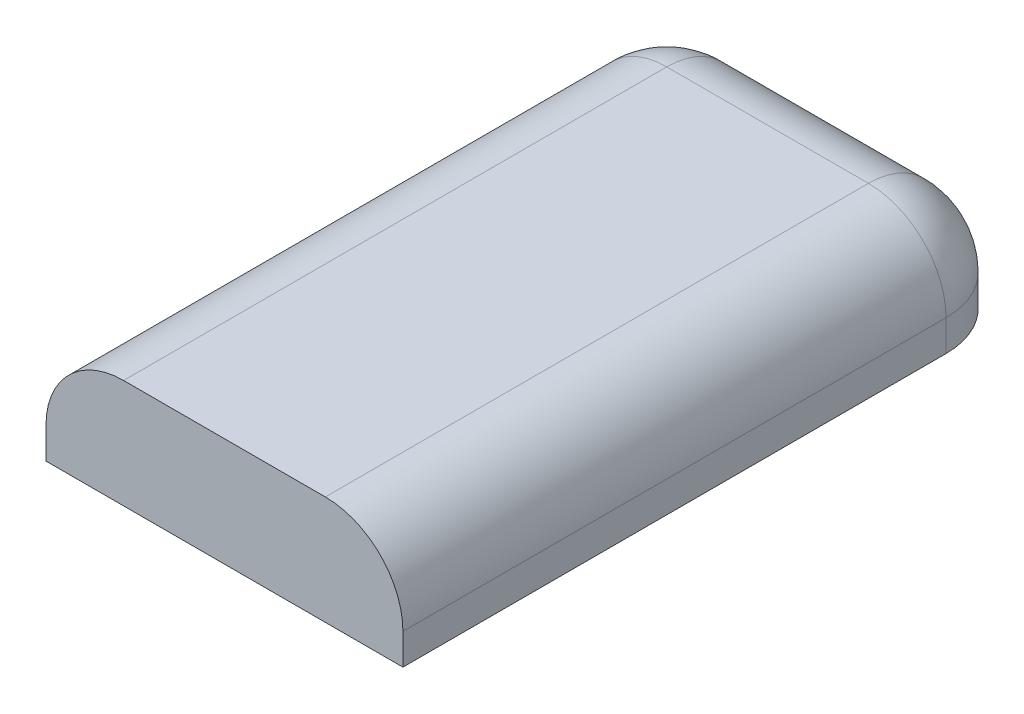
ISO-10303-21;
HEADER;
FILE_DESCRIPTION(('STEP AP214'),'2;1');
FILE_NAME('part.step','',(''),(''),'','','');
FILE_SCHEMA(('AUTOMOTIVE_DESIGN { 1 0 10303 214 1 1 1 1 }'));
ENDSEC;
DATA;
#1=APPLICATION_CONTEXT('core data for automotive mechanical design processes');
#2=APPLICATION_PROTOCOL_DEFINITION('international standard','automotive_design',2000,#1);
#3=PRODUCT_CONTEXT('',#1,'mechanical');
#4=PRODUCT('Part','Part','',(#3));
#5=PRODUCT_RELATED_PRODUCT_CATEGORY('part','',(#4));
#6=PRODUCT_DEFINITION_FORMATION('','',#4);
#7=PRODUCT_DEFINITION_CONTEXT('part definition',#1,'design');
#8=PRODUCT_DEFINITION('design','',#6,#7);
#9=PRODUCT_DEFINITION_SHAPE('','',#8);
#10=(LENGTH_UNIT() NAMED_UNIT(*) SI_UNIT(.MILLI.,.METRE.));
#11=(NAMED_UNIT(*) PLANE_ANGLE_UNIT() SI_UNIT($,.RADIAN.));
#12=(NAMED_UNIT(*) SI_UNIT($,.STERADIAN.) SOLID_ANGLE_UNIT());
#13=UNCERTAINTY_MEASURE_WITH_UNIT(LENGTH_MEASURE(1.E-05),#10,'distance_accuracy_value','');
#14=(GEOMETRIC_REPRESENTATION_CONTEXT(3) GLOBAL_UNCERTAINTY_ASSIGNED_CONTEXT((#13)) GLOBAL_UNIT_ASSIGNED_CONTEXT((#10,
#11,#12)) REPRESENTATION_CONTEXT('',''));
#15=CARTESIAN_POINT('',(0.,0.,0.));
#16=DIRECTION('',(0.,0.,1.));
#17=DIRECTION('',(1.,0.,0.));
#18=AXIS2_PLACEMENT_3D('',#15,#16,#17);
#19=CARTESIAN_POINT('',(11.5,7.,-20.));
#20=DIRECTION('',(-1.,0.,0.));
#21=DIRECTION('',(0.,0.,1.));
#22=AXIS2_PLACEMENT_3D('',#19,#20,#21);
#23=PLANE('',#22);
#24=DIRECTION('',(0.,-1.,0.));
#25=VECTOR('',#24,1.);
#26=CARTESIAN_POINT('',(11.5,7.,-15.));
#27=LINE('',#26,#25);
#28=CARTESIAN_POINT('',(11.5,0.,-15.));
#29=VERTEX_POINT('',#28);
#30=CARTESIAN_POINT('',(11.5,2.,-15.));
#31=VERTEX_POINT('',#30);
#32=EDGE_CURVE('E148',#29,#31,#27,.F.);
#33=ORIENTED_EDGE('',*,*,#32,.T.);
#34=DIRECTION('',(0.,0.,-1.));
#35=VECTOR('',#34,1.);
#36=CARTESIAN_POINT('',(11.5,2.,20.));
#37=LINE('',#36,#35);
#38=CARTESIAN_POINT('',(11.5,2.,20.));
#39=VERTEX_POINT('',#38);
#40=EDGE_CURVE('E11',#31,#39,#37,.F.);
#41=ORIENTED_EDGE('',*,*,#40,.T.);
#42=DIRECTION('',(0.,-1.,0.));
#43=VECTOR('',#42,1.);
#44=CARTESIAN_POINT('',(11.5,7.,20.));
#45=LINE('',#44,#43);
#46=CARTESIAN_POINT('',(11.5,0.,20.));
#47=VERTEX_POINT('',#46);
#48=EDGE_CURVE('E117',#39,#47,#45,.T.);
#49=ORIENTED_EDGE('',*,*,#48,.T.);
#50=DIRECTION('',(0.,0.,-1.));
#51=VECTOR('',#50,1.);
#52=CARTESIAN_POINT('',(11.5,0.,-20.));
#53=LINE('',#52,#51);
#54=EDGE_CURVE('E131',#47,#29,#53,.T.);
#55=ORIENTED_EDGE('',*,*,#54,.T.);
#56=EDGE_LOOP('',(#33,#41,#49,#55));
#57=FACE_BOUND('',#56,.T.);
#58=ADVANCED_FACE('F38',(#57),#23,.F.);
#59=CARTESIAN_POINT('',(-11.5,7.,-20.));
#60=DIRECTION('',(0.,0.,1.));
#61=DIRECTION('',(1.,0.,0.));
#62=AXIS2_PLACEMENT_3D('',#59,#60,#61);
#63=PLANE('',#62);
#64=DIRECTION('',(0.,-1.,0.));
#65=VECTOR('',#64,1.);
#66=CARTESIAN_POINT('',(-6.50000000000001,7.,-20.));
#67=LINE('',#66,#65);
#68=CARTESIAN_POINT('',(-6.50000000000001,0.,-20.));
#69=VERTEX_POINT('',#68);
#70=CARTESIAN_POINT('',(-6.50000000000001,2.,-20.));
#71=VERTEX_POINT('',#70);
#72=EDGE_CURVE('E142',#69,#71,#67,.F.);
#73=ORIENTED_EDGE('',*,*,#72,.T.);
#74=DIRECTION('',(-1.,0.,0.));
#75=VECTOR('',#74,1.);
#76=CARTESIAN_POINT('',(6.49999999999999,2.,-20.));
#77=LINE('',#76,#75);
#78=CARTESIAN_POINT('',(6.49999999999999,2.,-20.));
#79=VERTEX_POINT('',#78);
#80=EDGE_CURVE('E62',#71,#79,#77,.F.);
#81=ORIENTED_EDGE('',*,*,#80,.T.);
#82=DIRECTION('',(0.,-1.,0.));
#83=VECTOR('',#82,1.);
#84=CARTESIAN_POINT('',(6.49999999999999,7.,-20.));
#85=LINE('',#84,#83);
#86=CARTESIAN_POINT('',(6.49999999999999,0.,-20.));
#87=VERTEX_POINT('',#86);
#88=EDGE_CURVE('E144',#79,#87,#85,.T.);
#89=ORIENTED_EDGE('',*,*,#88,.T.);
#90=DIRECTION('',(-1.,0.,0.));
#91=VECTOR('',#90,1.);
#92=CARTESIAN_POINT('',(-11.5,0.,-20.));
#93=LINE('',#92,#91);
#94=EDGE_CURVE('E126',#87,#69,#93,.T.);
#95=ORIENTED_EDGE('',*,*,#94,.T.);
#96=EDGE_LOOP('',(#73,#81,#89,#95));
#97=FACE_BOUND('',#96,.T.);
#98=ADVANCED_FACE('F181',(#97),#63,.F.);
#99=CARTESIAN_POINT('',(-11.5,7.,-20.));
#100=DIRECTION('',(1.,0.,0.));
#101=DIRECTION('',(0.,0.,-1.));
#102=AXIS2_PLACEMENT_3D('',#99,#100,#101);
#103=PLANE('',#102);
#104=DIRECTION('',(0.,-1.,0.));
#105=VECTOR('',#104,1.);
#106=CARTESIAN_POINT('',(-11.5,7.,20.));
#107=LINE('',#106,#105);
#108=CARTESIAN_POINT('',(-11.5,2.,20.));
#109=VERTEX_POINT('',#108);
#110=CARTESIAN_POINT('',(-11.5,0.,20.));
#111=VERTEX_POINT('',#110);
#112=EDGE_CURVE('E105',#109,#111,#107,.T.);
#113=ORIENTED_EDGE('',*,*,#112,.F.);
#114=DIRECTION('',(0.,0.,1.));
#115=VECTOR('',#114,1.);
#116=CARTESIAN_POINT('',(-11.5,2.,-15.));
#117=LINE('',#116,#115);
#118=CARTESIAN_POINT('',(-11.5,2.,-15.));
#119=VERTEX_POINT('',#118);
#120=EDGE_CURVE('E160',#109,#119,#117,.F.);
#121=ORIENTED_EDGE('',*,*,#120,.T.);
#122=DIRECTION('',(0.,-1.,0.));
#123=VECTOR('',#122,1.);
#124=CARTESIAN_POINT('',(-11.5,7.,-15.));
#125=LINE('',#124,#123);
#126=CARTESIAN_POINT('',(-11.5,0.,-15.));
#127=VERTEX_POINT('',#126);
#128=EDGE_CURVE('E116',#119,#127,#125,.T.);
#129=ORIENTED_EDGE('',*,*,#128,.T.);
#130=DIRECTION('',(0.,0.,1.));
#131=VECTOR('',#130,1.);
#132=CARTESIAN_POINT('',(-11.5,0.,-20.));
#133=LINE('',#132,#131);
#134=EDGE_CURVE('E120',#127,#111,#133,.T.);
#135=ORIENTED_EDGE('',*,*,#134,.T.);
#136=EDGE_LOOP('',(#113,#121,#129,#135));
#137=FACE_BOUND('',#136,.T.);
#138=ADVANCED_FACE('F121',(#137),#103,.F.);
#139=CARTESIAN_POINT('',(-11.5,7.,20.));
#140=DIRECTION('',(0.,0.,-1.));
#141=DIRECTION('',(-1.,0.,0.));
#142=AXIS2_PLACEMENT_3D('',#139,#140,#141);
#143=PLANE('',#142);
#144=DIRECTION('',(1.,0.,0.));
#145=VECTOR('',#144,1.);
#146=CARTESIAN_POINT('',(-11.5,7.,20.));
#147=LINE('',#146,#145);
#148=CARTESIAN_POINT('',(-6.5,7.,20.));
#149=VERTEX_POINT('',#148);
#150=CARTESIAN_POINT('',(6.5,7.,20.));
#151=VERTEX_POINT('',#150);
#152=EDGE_CURVE('E132',#149,#151,#147,.T.);
#153=ORIENTED_EDGE('',*,*,#152,.F.);
#154=CARTESIAN_POINT('',(-6.5,2.,20.));
#155=DIRECTION('',(0.,0.,-1.));
#156=DIRECTION('',(-1.,0.,0.));
#157=AXIS2_PLACEMENT_3D('',#154,#155,#156);
#158=CIRCLE('',#157,5.);
#159=EDGE_CURVE('E113',#149,#109,#158,.F.);
#160=ORIENTED_EDGE('',*,*,#159,.T.);
#161=ORIENTED_EDGE('',*,*,#112,.T.);
#162=DIRECTION('',(1.,0.,0.));
#163=VECTOR('',#162,1.);
#164=CARTESIAN_POINT('',(-11.5,0.,20.));
#165=LINE('',#164,#163);
#166=EDGE_CURVE('E111',#111,#47,#165,.T.);
#167=ORIENTED_EDGE('',*,*,#166,.T.);
#168=ORIENTED_EDGE('',*,*,#48,.F.);
#169=CARTESIAN_POINT('',(6.5,2.,20.));
#170=DIRECTION('',(0.,0.,-1.));
#171=DIRECTION('',(-1.,0.,0.));
#172=AXIS2_PLACEMENT_3D('',#169,#170,#171);
#173=CIRCLE('',#172,5.);
#174=EDGE_CURVE('E157',#39,#151,#173,.F.);
#175=ORIENTED_EDGE('',*,*,#174,.T.);
#176=EDGE_LOOP('',(#153,#160,#161,#167,#168,#175));
#177=FACE_BOUND('',#176,.T.);
#178=ADVANCED_FACE('F108',(#177),#143,.F.);
#179=CARTESIAN_POINT('',(0.,7.,0.));
#180=DIRECTION('',(0.,1.,0.));
#181=DIRECTION('',(0.,0.,1.));
#182=AXIS2_PLACEMENT_3D('',#179,#180,#181);
#183=PLANE('',#182);
#184=DIRECTION('',(-1.,0.,0.));
#185=VECTOR('',#184,1.);
#186=CARTESIAN_POINT('',(-6.50000000000001,7.,-15.));
#187=LINE('',#186,#185);
#188=CARTESIAN_POINT('',(6.49999999999999,7.,-15.));
#189=VERTEX_POINT('',#188);
#190=CARTESIAN_POINT('',(-6.50000000000001,7.,-15.));
#191=VERTEX_POINT('',#190);
#192=EDGE_CURVE('E152',#189,#191,#187,.T.);
#193=ORIENTED_EDGE('',*,*,#192,.T.);
#194=DIRECTION('',(0.,0.,1.));
#195=VECTOR('',#194,1.);
#196=CARTESIAN_POINT('',(-6.5,7.,20.));
#197=LINE('',#196,#195);
#198=EDGE_CURVE('E154',#191,#149,#197,.T.);
#199=ORIENTED_EDGE('',*,*,#198,.T.);
#200=ORIENTED_EDGE('',*,*,#152,.T.);
#201=DIRECTION('',(0.,0.,-1.));
#202=VECTOR('',#201,1.);
#203=CARTESIAN_POINT('',(6.49999999999999,7.,-15.));
#204=LINE('',#203,#202);
#205=EDGE_CURVE('E150',#151,#189,#204,.T.);
#206=ORIENTED_EDGE('',*,*,#205,.T.);
#207=EDGE_LOOP('',(#193,#199,#200,#206));
#208=FACE_BOUND('',#207,.T.);
#209=ADVANCED_FACE('F195',(#208),#183,.T.);
#210=CARTESIAN_POINT('',(0.,0.,0.));
#211=DIRECTION('',(0.,1.,0.));
#212=DIRECTION('',(0.,0.,1.));
#213=AXIS2_PLACEMENT_3D('',#210,#211,#212);
#214=PLANE('',#213);
#215=ORIENTED_EDGE('',*,*,#94,.F.);
#216=CARTESIAN_POINT('',(6.49999999999999,0.,-15.));
#217=DIRECTION('',(0.,1.,0.));
#218=DIRECTION('',(0.,0.,1.));
#219=AXIS2_PLACEMENT_3D('',#216,#217,#218);
#220=CIRCLE('',#219,5.);
#221=EDGE_CURVE('E146',#87,#29,#220,.F.);
#222=ORIENTED_EDGE('',*,*,#221,.T.);
#223=ORIENTED_EDGE('',*,*,#54,.F.);
#224=ORIENTED_EDGE('',*,*,#166,.F.);
#225=ORIENTED_EDGE('',*,*,#134,.F.);
#226=CARTESIAN_POINT('',(-6.50000000000001,0.,-15.));
#227=DIRECTION('',(0.,1.,0.));
#228=DIRECTION('',(0.,0.,1.));
#229=AXIS2_PLACEMENT_3D('',#226,#227,#228);
#230=CIRCLE('',#229,5.);
#231=EDGE_CURVE('E140',#127,#69,#230,.F.);
#232=ORIENTED_EDGE('',*,*,#231,.T.);
#233=EDGE_LOOP('',(#215,#222,#223,#224,#225,#232));
#234=FACE_BOUND('',#233,.T.);
#235=ADVANCED_FACE('F129',(#234),#214,.F.);
#236=CARTESIAN_POINT('',(-6.50000000000001,7.,-15.));
#237=DIRECTION('',(0.,-1.,0.));
#238=DIRECTION('',(0.,0.,-1.));
#239=AXIS2_PLACEMENT_3D('',#236,#237,#238);
#240=CYLINDRICAL_SURFACE('',#239,5.);
#241=ORIENTED_EDGE('',*,*,#128,.F.);
#242=CARTESIAN_POINT('',(-6.50000000000001,2.,-15.));
#243=DIRECTION('',(0.,-1.,0.));
#244=DIRECTION('',(0.,0.,-1.));
#245=AXIS2_PLACEMENT_3D('',#242,#243,#244);
#246=CIRCLE('',#245,5.);
#247=EDGE_CURVE('E162',#119,#71,#246,.T.);
#248=ORIENTED_EDGE('',*,*,#247,.T.);
#249=ORIENTED_EDGE('',*,*,#72,.F.);
#250=ORIENTED_EDGE('',*,*,#231,.F.);
#251=EDGE_LOOP('',(#241,#248,#249,#250));
#252=FACE_BOUND('',#251,.T.);
#253=ADVANCED_FACE('F185',(#252),#240,.T.);
#254=CARTESIAN_POINT('',(6.49999999999999,7.,-15.));
#255=DIRECTION('',(0.,-1.,0.));
#256=DIRECTION('',(0.,0.,-1.));
#257=AXIS2_PLACEMENT_3D('',#254,#255,#256);
#258=CYLINDRICAL_SURFACE('',#257,5.);
#259=ORIENTED_EDGE('',*,*,#88,.F.);
#260=CARTESIAN_POINT('',(6.49999999999999,2.,-15.));
#261=DIRECTION('',(0.,-1.,0.));
#262=DIRECTION('',(0.,0.,-1.));
#263=AXIS2_PLACEMENT_3D('',#260,#261,#262);
#264=CIRCLE('',#263,5.);
#265=EDGE_CURVE('E47',#79,#31,#264,.T.);
#266=ORIENTED_EDGE('',*,*,#265,.T.);
#267=ORIENTED_EDGE('',*,*,#32,.F.);
#268=ORIENTED_EDGE('',*,*,#221,.F.);
#269=EDGE_LOOP('',(#259,#266,#267,#268));
#270=FACE_BOUND('',#269,.T.);
#271=ADVANCED_FACE('F219',(#270),#258,.T.);
#272=CARTESIAN_POINT('',(6.5,2.,0.));
#273=DIRECTION('',(0.,0.,1.));
#274=DIRECTION('',(1.,0.,0.));
#275=AXIS2_PLACEMENT_3D('',#272,#273,#274);
#276=CYLINDRICAL_SURFACE('',#275,5.);
#277=ORIENTED_EDGE('',*,*,#174,.F.);
#278=ORIENTED_EDGE('',*,*,#40,.F.);
#279=CARTESIAN_POINT('',(6.49999999999999,2.,-15.));
#280=DIRECTION('',(0.,0.,-1.));
#281=DIRECTION('',(-1.,0.,0.));
#282=AXIS2_PLACEMENT_3D('',#279,#280,#281);
#283=CIRCLE('',#282,5.);
#284=EDGE_CURVE('E42',#189,#31,#283,.T.);
#285=ORIENTED_EDGE('',*,*,#284,.F.);
#286=ORIENTED_EDGE('',*,*,#205,.F.);
#287=EDGE_LOOP('',(#277,#278,#285,#286));
#288=FACE_BOUND('',#287,.T.);
#289=ADVANCED_FACE('F40',(#288),#276,.T.);
#290=CARTESIAN_POINT('',(6.49999999999999,2.,-15.));
#291=DIRECTION('',(0.,1.,0.));
#292=DIRECTION('',(0.,0.,1.));
#293=AXIS2_PLACEMENT_3D('',#290,#291,#292);
#294=SPHERICAL_SURFACE('',#293,5.);
#295=ORIENTED_EDGE('',*,*,#284,.T.);
#296=ORIENTED_EDGE('',*,*,#265,.F.);
#297=CARTESIAN_POINT('',(6.49999999999999,2.,-15.));
#298=DIRECTION('',(-1.,0.,0.));
#299=DIRECTION('',(0.,0.,1.));
#300=AXIS2_PLACEMENT_3D('',#297,#298,#299);
#301=CIRCLE('',#300,5.);
#302=EDGE_CURVE('E171',#189,#79,#301,.T.);
#303=ORIENTED_EDGE('',*,*,#302,.F.);
#304=EDGE_LOOP('',(#295,#296,#303));
#305=FACE_BOUND('',#304,.T.);
#306=ADVANCED_FACE('F200',(#305),#294,.T.);
#307=CARTESIAN_POINT('',(0.,2.,-15.));
#308=DIRECTION('',(1.,0.,0.));
#309=DIRECTION('',(0.,0.,-1.));
#310=AXIS2_PLACEMENT_3D('',#307,#308,#309);
#311=CYLINDRICAL_SURFACE('',#310,5.);
#312=ORIENTED_EDGE('',*,*,#302,.T.);
#313=ORIENTED_EDGE('',*,*,#80,.F.);
#314=CARTESIAN_POINT('',(-6.50000000000001,2.,-15.));
#315=DIRECTION('',(-1.,0.,0.));
#316=DIRECTION('',(0.,0.,1.));
#317=AXIS2_PLACEMENT_3D('',#314,#315,#316);
#318=CIRCLE('',#317,5.);
#319=EDGE_CURVE('E169',#191,#71,#318,.T.);
#320=ORIENTED_EDGE('',*,*,#319,.F.);
#321=ORIENTED_EDGE('',*,*,#192,.F.);
#322=EDGE_LOOP('',(#312,#313,#320,#321));
#323=FACE_BOUND('',#322,.T.);
#324=ADVANCED_FACE('F201',(#323),#311,.T.);
#325=CARTESIAN_POINT('',(-6.50000000000001,2.,-15.));
#326=DIRECTION('',(0.,1.,0.));
#327=DIRECTION('',(0.,0.,1.));
#328=AXIS2_PLACEMENT_3D('',#325,#326,#327);
#329=SPHERICAL_SURFACE('',#328,5.);
#330=ORIENTED_EDGE('',*,*,#319,.T.);
#331=ORIENTED_EDGE('',*,*,#247,.F.);
#332=CARTESIAN_POINT('',(-6.50000000000001,2.,-15.));
#333=DIRECTION('',(0.,0.,1.));
#334=DIRECTION('',(1.,0.,0.));
#335=AXIS2_PLACEMENT_3D('',#332,#333,#334);
#336=CIRCLE('',#335,5.);
#337=EDGE_CURVE('E166',#191,#119,#336,.T.);
#338=ORIENTED_EDGE('',*,*,#337,.F.);
#339=EDGE_LOOP('',(#330,#331,#338));
#340=FACE_BOUND('',#339,.T.);
#341=ADVANCED_FACE('F189',(#340),#329,.T.);
#342=CARTESIAN_POINT('',(-6.50000000000001,2.,0.));
#343=DIRECTION('',(0.,0.,-1.));
#344=DIRECTION('',(-1.,0.,0.));
#345=AXIS2_PLACEMENT_3D('',#342,#343,#344);
#346=CYLINDRICAL_SURFACE('',#345,5.);
#347=ORIENTED_EDGE('',*,*,#337,.T.);
#348=ORIENTED_EDGE('',*,*,#120,.F.);
#349=ORIENTED_EDGE('',*,*,#159,.F.);
#350=ORIENTED_EDGE('',*,*,#198,.F.);
#351=EDGE_LOOP('',(#347,#348,#349,#350));
#352=FACE_BOUND('',#351,.T.);
#353=ADVANCED_FACE('F193',(#352),#346,.T.);
#354=CLOSED_SHELL('',(#58,#98,#138,#178,#209,#235,#253,#271,#289,#306,#324,#341,#353));
#355=MANIFOLD_SOLID_BREP('B2',#354);
#356=ADVANCED_BREP_SHAPE_REPRESENTATION('',(#18,#355),#14);
#357=SHAPE_DEFINITION_REPRESENTATION(#9,#356);
ENDSEC;
END-ISO-10303-21;
